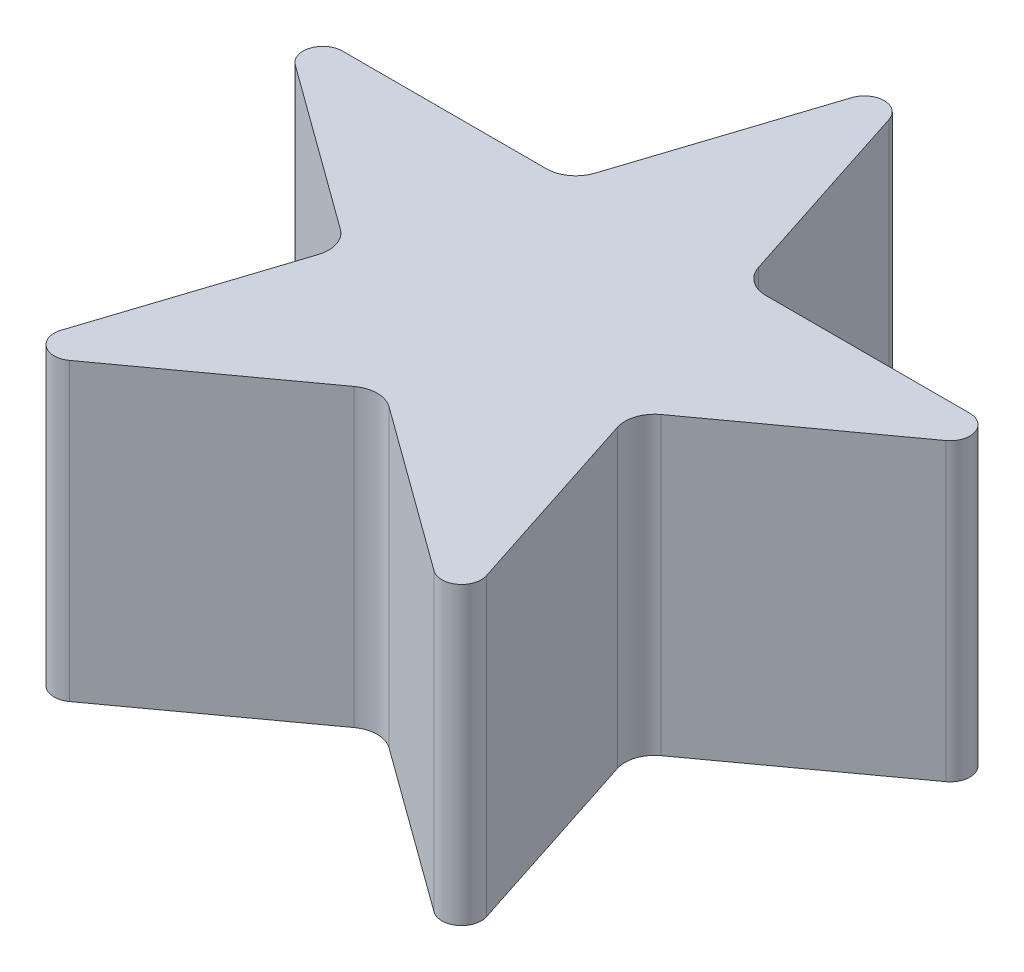
ISO-10303-21;
HEADER;
FILE_DESCRIPTION(('STEP AP214'),'2;1');
FILE_NAME('part.step','',(''),(''),'','','');
FILE_SCHEMA(('AUTOMOTIVE_DESIGN { 1 0 10303 214 1 1 1 1 }'));
ENDSEC;
DATA;
#1=APPLICATION_CONTEXT('core data for automotive mechanical design processes');
#2=APPLICATION_PROTOCOL_DEFINITION('international standard','automotive_design',2000,#1);
#3=PRODUCT_CONTEXT('',#1,'mechanical');
#4=PRODUCT('Part','Part','',(#3));
#5=PRODUCT_RELATED_PRODUCT_CATEGORY('part','',(#4));
#6=PRODUCT_DEFINITION_FORMATION('','',#4);
#7=PRODUCT_DEFINITION_CONTEXT('part definition',#1,'design');
#8=PRODUCT_DEFINITION('design','',#6,#7);
#9=PRODUCT_DEFINITION_SHAPE('','',#8);
#10=(LENGTH_UNIT() NAMED_UNIT(*) SI_UNIT(.MILLI.,.METRE.));
#11=(NAMED_UNIT(*) PLANE_ANGLE_UNIT() SI_UNIT($,.RADIAN.));
#12=(NAMED_UNIT(*) SI_UNIT($,.STERADIAN.) SOLID_ANGLE_UNIT());
#13=UNCERTAINTY_MEASURE_WITH_UNIT(LENGTH_MEASURE(1.E-05),#10,'distance_accuracy_value','');
#14=(GEOMETRIC_REPRESENTATION_CONTEXT(3) GLOBAL_UNCERTAINTY_ASSIGNED_CONTEXT((#13)) GLOBAL_UNIT_ASSIGNED_CONTEXT((#10,
#11,#12)) REPRESENTATION_CONTEXT('',''));
#15=CARTESIAN_POINT('',(0.,0.,0.));
#16=DIRECTION('',(0.,0.,1.));
#17=DIRECTION('',(1.,0.,0.));
#18=AXIS2_PLACEMENT_3D('',#15,#16,#17);
#19=CARTESIAN_POINT('',(7.25857417505104,30.,9.99057026293918));
#20=DIRECTION('',(0.587785252292474,0.,0.809016994374947));
#21=DIRECTION('',(0.809016994374947,0.,-0.587785252292474));
#22=AXIS2_PLACEMENT_3D('',#19,#20,#21);
#23=PLANE('',#22);
#24=DIRECTION('',(-0.809016994374947,0.,0.587785252292474));
#25=VECTOR('',#24,1.);
#26=CARTESIAN_POINT('',(7.25857417505104,30.,9.99057026293918));
#27=LINE('',#26,#25);
#28=CARTESIAN_POINT('',(33.026591230526,30.,-8.73098999023093));
#29=VERTEX_POINT('',#28);
#30=CARTESIAN_POINT('',(16.2805041069795,30.,3.43575448270865));
#31=VERTEX_POINT('',#30);
#32=EDGE_CURVE('E187',#29,#31,#27,.T.);
#33=ORIENTED_EDGE('',*,*,#32,.T.);
#34=DIRECTION('',(0.,-1.,0.));
#35=VECTOR('',#34,1.);
#36=CARTESIAN_POINT('',(16.2805041069795,0.,3.43575448270865));
#37=LINE('',#36,#35);
#38=CARTESIAN_POINT('',(16.2805041069795,0.,3.43575448270865));
#39=VERTEX_POINT('',#38);
#40=EDGE_CURVE('E267',#31,#39,#37,.T.);
#41=ORIENTED_EDGE('',*,*,#40,.T.);
#42=DIRECTION('',(-0.809016994374947,0.,0.587785252292474));
#43=VECTOR('',#42,1.);
#44=CARTESIAN_POINT('',(7.25857417505104,0.,9.99057026293918));
#45=LINE('',#44,#43);
#46=CARTESIAN_POINT('',(33.026591230526,0.,-8.73098999023093));
#47=VERTEX_POINT('',#46);
#48=EDGE_CURVE('E372',#47,#39,#45,.T.);
#49=ORIENTED_EDGE('',*,*,#48,.F.);
#50=DIRECTION('',(0.,-1.,0.));
#51=VECTOR('',#50,1.);
#52=CARTESIAN_POINT('',(33.026591230526,30.,-8.73098999023092));
#53=LINE('',#52,#51);
#54=EDGE_CURVE('E233',#47,#29,#53,.F.);
#55=ORIENTED_EDGE('',*,*,#54,.T.);
#56=EDGE_LOOP('',(#33,#41,#49,#55));
#57=FACE_BOUND('',#56,.T.);
#58=ADVANCED_FACE('F41',(#57),#23,.T.);
#59=CARTESIAN_POINT('',(0.,30.,-12.3490239789808));
#60=DIRECTION('',(0.,0.,1.));
#61=DIRECTION('',(1.,0.,0.));
#62=AXIS2_PLACEMENT_3D('',#59,#60,#61);
#63=PLANE('',#62);
#64=DIRECTION('',(-1.,0.,0.));
#65=VECTOR('',#64,1.);
#66=CARTESIAN_POINT('',(0.,0.,-12.3490239789808));
#67=LINE('',#66,#65);
#68=CARTESIAN_POINT('',(31.8510207259411,0.,-12.3490239789808));
#69=VERTEX_POINT('',#68);
#70=CARTESIAN_POINT('',(11.1517186841036,0.,-12.3490239789808));
#71=VERTEX_POINT('',#70);
#72=EDGE_CURVE('E374',#69,#71,#67,.T.);
#73=ORIENTED_EDGE('',*,*,#72,.T.);
#74=DIRECTION('',(0.,-1.,0.));
#75=VECTOR('',#74,1.);
#76=CARTESIAN_POINT('',(11.1517186841036,30.,-12.3490239789808));
#77=LINE('',#76,#75);
#78=CARTESIAN_POINT('',(11.1517186841036,30.,-12.3490239789808));
#79=VERTEX_POINT('',#78);
#80=EDGE_CURVE('E62',#71,#79,#77,.F.);
#81=ORIENTED_EDGE('',*,*,#80,.T.);
#82=DIRECTION('',(-1.,0.,0.));
#83=VECTOR('',#82,1.);
#84=CARTESIAN_POINT('',(0.,30.,-12.3490239789808));
#85=LINE('',#84,#83);
#86=CARTESIAN_POINT('',(31.8510207259411,30.,-12.3490239789808));
#87=VERTEX_POINT('',#86);
#88=EDGE_CURVE('E302',#87,#79,#85,.T.);
#89=ORIENTED_EDGE('',*,*,#88,.F.);
#90=DIRECTION('',(0.,-1.,0.));
#91=VECTOR('',#90,1.);
#92=CARTESIAN_POINT('',(31.8510207259411,0.,-12.3490239789808));
#93=LINE('',#92,#91);
#94=EDGE_CURVE('E230',#87,#69,#93,.T.);
#95=ORIENTED_EDGE('',*,*,#94,.T.);
#96=EDGE_LOOP('',(#73,#81,#89,#95));
#97=FACE_BOUND('',#96,.T.);
#98=ADVANCED_FACE('F316',(#97),#63,.F.);
#99=CARTESIAN_POINT('',(11.7446197250948,30.,-3.81605827344881));
#100=DIRECTION('',(0.951056516295153,0.,-0.309016994374949));
#101=DIRECTION('',(-0.309016994374949,0.,-0.951056516295153));
#102=AXIS2_PLACEMENT_3D('',#99,#100,#101);
#103=PLANE('',#102);
#104=DIRECTION('',(0.309016994374949,0.,0.951056516295153));
#105=VECTOR('',#104,1.);
#106=CARTESIAN_POINT('',(11.7446197250948,30.,-3.81605827344881));
#107=LINE('',#106,#105);
#108=CARTESIAN_POINT('',(1.90211303259027,30.,-34.1081790855071));
#109=VERTEX_POINT('',#108);
#110=CARTESIAN_POINT('',(8.29854913521813,30.,-14.4219729958559));
#111=VERTEX_POINT('',#110);
#112=EDGE_CURVE('E422',#109,#111,#107,.T.);
#113=ORIENTED_EDGE('',*,*,#112,.T.);
#114=DIRECTION('',(0.,-1.,0.));
#115=VECTOR('',#114,1.);
#116=CARTESIAN_POINT('',(8.29854913521813,30.,-14.421972995856));
#117=LINE('',#116,#115);
#118=CARTESIAN_POINT('',(8.29854913521813,0.,-14.4219729958559));
#119=VERTEX_POINT('',#118);
#120=EDGE_CURVE('E272',#111,#119,#117,.T.);
#121=ORIENTED_EDGE('',*,*,#120,.T.);
#122=DIRECTION('',(0.309016994374949,0.,0.951056516295153));
#123=VECTOR('',#122,1.);
#124=CARTESIAN_POINT('',(11.7446197250948,0.,-3.81605827344881));
#125=LINE('',#124,#123);
#126=CARTESIAN_POINT('',(1.90211303259027,0.,-34.1081790855071));
#127=VERTEX_POINT('',#126);
#128=EDGE_CURVE('E376',#127,#119,#125,.T.);
#129=ORIENTED_EDGE('',*,*,#128,.F.);
#130=DIRECTION('',(0.,-1.,0.));
#131=VECTOR('',#130,1.);
#132=CARTESIAN_POINT('',(1.90211303259027,30.,-34.1081790855071));
#133=LINE('',#132,#131);
#134=EDGE_CURVE('E250',#127,#109,#133,.F.);
#135=ORIENTED_EDGE('',*,*,#134,.T.);
#136=EDGE_LOOP('',(#113,#121,#129,#135));
#137=FACE_BOUND('',#136,.T.);
#138=ADVANCED_FACE('F322',(#137),#103,.T.);
#139=CARTESIAN_POINT('',(-11.7446197250948,30.,-3.81605827344878));
#140=DIRECTION('',(0.951056516295154,0.,0.309016994374946));
#141=DIRECTION('',(0.309016994374946,0.,-0.951056516295154));
#142=AXIS2_PLACEMENT_3D('',#139,#140,#141);
#143=PLANE('',#142);
#144=DIRECTION('',(-0.309016994374946,0.,0.951056516295154));
#145=VECTOR('',#144,1.);
#146=CARTESIAN_POINT('',(-11.7446197250948,0.,-3.81605827344878));
#147=LINE('',#146,#145);
#148=CARTESIAN_POINT('',(-1.90211303259034,0.,-34.1081790855071));
#149=VERTEX_POINT('',#148);
#150=CARTESIAN_POINT('',(-8.29854913521815,0.,-14.4219729958559));
#151=VERTEX_POINT('',#150);
#152=EDGE_CURVE('E378',#149,#151,#147,.T.);
#153=ORIENTED_EDGE('',*,*,#152,.T.);
#154=DIRECTION('',(0.,-1.,0.));
#155=VECTOR('',#154,1.);
#156=CARTESIAN_POINT('',(-8.29854913521815,30.,-14.4219729958559));
#157=LINE('',#156,#155);
#158=CARTESIAN_POINT('',(-8.29854913521815,30.,-14.4219729958559));
#159=VERTEX_POINT('',#158);
#160=EDGE_CURVE('E255',#151,#159,#157,.F.);
#161=ORIENTED_EDGE('',*,*,#160,.T.);
#162=DIRECTION('',(-0.309016994374946,0.,0.951056516295154));
#163=VECTOR('',#162,1.);
#164=CARTESIAN_POINT('',(-11.7446197250948,30.,-3.81605827344878));
#165=LINE('',#164,#163);
#166=CARTESIAN_POINT('',(-1.90211303259034,30.,-34.1081790855071));
#167=VERTEX_POINT('',#166);
#168=EDGE_CURVE('E418',#167,#159,#165,.T.);
#169=ORIENTED_EDGE('',*,*,#168,.F.);
#170=DIRECTION('',(0.,-1.,0.));
#171=VECTOR('',#170,1.);
#172=CARTESIAN_POINT('',(-1.90211303259034,0.,-34.108179085507));
#173=LINE('',#172,#171);
#174=EDGE_CURVE('E247',#167,#149,#173,.T.);
#175=ORIENTED_EDGE('',*,*,#174,.T.);
#176=EDGE_LOOP('',(#153,#161,#169,#175));
#177=FACE_BOUND('',#176,.T.);
#178=ADVANCED_FACE('F417',(#177),#143,.F.);
#179=CARTESIAN_POINT('',(0.,30.,-12.3490239789808));
#180=DIRECTION('',(0.,0.,1.));
#181=DIRECTION('',(1.,0.,0.));
#182=AXIS2_PLACEMENT_3D('',#179,#180,#181);
#183=PLANE('',#182);
#184=DIRECTION('',(-1.,0.,0.));
#185=VECTOR('',#184,1.);
#186=CARTESIAN_POINT('',(0.,30.,-12.3490239789808));
#187=LINE('',#186,#185);
#188=CARTESIAN_POINT('',(-11.1517186841036,30.,-12.3490239789808));
#189=VERTEX_POINT('',#188);
#190=CARTESIAN_POINT('',(-31.8510207259411,30.,-12.3490239789807));
#191=VERTEX_POINT('',#190);
#192=EDGE_CURVE('E366',#189,#191,#187,.T.);
#193=ORIENTED_EDGE('',*,*,#192,.F.);
#194=DIRECTION('',(0.,-1.,0.));
#195=VECTOR('',#194,1.);
#196=CARTESIAN_POINT('',(-11.1517186841036,0.,-12.3490239789808));
#197=LINE('',#196,#195);
#198=CARTESIAN_POINT('',(-11.1517186841036,0.,-12.3490239789808));
#199=VERTEX_POINT('',#198);
#200=EDGE_CURVE('E252',#189,#199,#197,.T.);
#201=ORIENTED_EDGE('',*,*,#200,.T.);
#202=DIRECTION('',(-1.,0.,0.));
#203=VECTOR('',#202,1.);
#204=CARTESIAN_POINT('',(0.,0.,-12.3490239789808));
#205=LINE('',#204,#203);
#206=CARTESIAN_POINT('',(-31.8510207259411,0.,-12.3490239789807));
#207=VERTEX_POINT('',#206);
#208=EDGE_CURVE('E381',#199,#207,#205,.T.);
#209=ORIENTED_EDGE('',*,*,#208,.T.);
#210=DIRECTION('',(0.,-1.,0.));
#211=VECTOR('',#210,1.);
#212=CARTESIAN_POINT('',(-31.8510207259411,30.,-12.3490239789807));
#213=LINE('',#212,#211);
#214=EDGE_CURVE('E244',#207,#191,#213,.F.);
#215=ORIENTED_EDGE('',*,*,#214,.T.);
#216=EDGE_LOOP('',(#193,#201,#209,#215));
#217=FACE_BOUND('',#216,.T.);
#218=ADVANCED_FACE('F410',(#217),#183,.F.);
#219=CARTESIAN_POINT('',(-7.25857417505101,30.,9.9905702629392));
#220=DIRECTION('',(-0.587785252292472,0.,0.809016994374948));
#221=DIRECTION('',(0.809016994374948,0.,0.587785252292472));
#222=AXIS2_PLACEMENT_3D('',#219,#220,#221);
#223=PLANE('',#222);
#224=DIRECTION('',(-0.809016994374948,0.,-0.587785252292472));
#225=VECTOR('',#224,1.);
#226=CARTESIAN_POINT('',(-7.25857417505101,0.,9.9905702629392));
#227=LINE('',#226,#225);
#228=CARTESIAN_POINT('',(-16.2805041069794,0.,3.43575448270869));
#229=VERTEX_POINT('',#228);
#230=CARTESIAN_POINT('',(-33.0265912305261,0.,-8.73098999023085));
#231=VERTEX_POINT('',#230);
#232=EDGE_CURVE('E383',#229,#231,#227,.T.);
#233=ORIENTED_EDGE('',*,*,#232,.F.);
#234=DIRECTION('',(0.,-1.,0.));
#235=VECTOR('',#234,1.);
#236=CARTESIAN_POINT('',(-16.2805041069794,30.,3.43575448270869));
#237=LINE('',#236,#235);
#238=CARTESIAN_POINT('',(-16.2805041069794,30.,3.43575448270869));
#239=VERTEX_POINT('',#238);
#240=EDGE_CURVE('E260',#229,#239,#237,.F.);
#241=ORIENTED_EDGE('',*,*,#240,.T.);
#242=DIRECTION('',(-0.809016994374948,0.,-0.587785252292472));
#243=VECTOR('',#242,1.);
#244=CARTESIAN_POINT('',(-7.25857417505101,30.,9.9905702629392));
#245=LINE('',#244,#243);
#246=CARTESIAN_POINT('',(-33.0265912305261,30.,-8.73098999023085));
#247=VERTEX_POINT('',#246);
#248=EDGE_CURVE('E357',#239,#247,#245,.T.);
#249=ORIENTED_EDGE('',*,*,#248,.T.);
#250=DIRECTION('',(0.,-1.,0.));
#251=VECTOR('',#250,1.);
#252=CARTESIAN_POINT('',(-33.0265912305261,0.,-8.73098999023085));
#253=LINE('',#252,#251);
#254=EDGE_CURVE('E241',#247,#231,#253,.T.);
#255=ORIENTED_EDGE('',*,*,#254,.T.);
#256=EDGE_LOOP('',(#233,#241,#249,#255));
#257=FACE_BOUND('',#256,.T.);
#258=ADVANCED_FACE('F402',(#257),#223,.T.);
#259=CARTESIAN_POINT('',(-11.7446197250948,30.,-3.81605827344878));
#260=DIRECTION('',(0.951056516295154,0.,0.309016994374946));
#261=DIRECTION('',(0.309016994374946,0.,-0.951056516295154));
#262=AXIS2_PLACEMENT_3D('',#259,#260,#261);
#263=PLANE('',#262);
#264=DIRECTION('',(-0.309016994374946,0.,0.951056516295154));
#265=VECTOR('',#264,1.);
#266=CARTESIAN_POINT('',(-11.7446197250948,30.,-3.81605827344878));
#267=LINE('',#266,#265);
#268=CARTESIAN_POINT('',(-15.1906903149714,30.,6.78985644895838));
#269=VERTEX_POINT('',#268);
#270=CARTESIAN_POINT('',(-21.5871264175992,30.,26.4760625386095));
#271=VERTEX_POINT('',#270);
#272=EDGE_CURVE('E356',#269,#271,#267,.T.);
#273=ORIENTED_EDGE('',*,*,#272,.F.);
#274=DIRECTION('',(0.,-1.,0.));
#275=VECTOR('',#274,1.);
#276=CARTESIAN_POINT('',(-15.1906903149714,30.,6.78985644895838));
#277=LINE('',#276,#275);
#278=CARTESIAN_POINT('',(-15.1906903149714,0.,6.78985644895838));
#279=VERTEX_POINT('',#278);
#280=EDGE_CURVE('E257',#269,#279,#277,.T.);
#281=ORIENTED_EDGE('',*,*,#280,.T.);
#282=DIRECTION('',(-0.309016994374946,0.,0.951056516295154));
#283=VECTOR('',#282,1.);
#284=CARTESIAN_POINT('',(-11.7446197250948,0.,-3.81605827344878));
#285=LINE('',#284,#283);
#286=CARTESIAN_POINT('',(-21.5871264175992,0.,26.4760625386095));
#287=VERTEX_POINT('',#286);
#288=EDGE_CURVE('E385',#279,#287,#285,.T.);
#289=ORIENTED_EDGE('',*,*,#288,.T.);
#290=DIRECTION('',(0.,-1.,0.));
#291=VECTOR('',#290,1.);
#292=CARTESIAN_POINT('',(-21.5871264175992,30.,26.4760625386095));
#293=LINE('',#292,#291);
#294=EDGE_CURVE('E238',#287,#271,#293,.F.);
#295=ORIENTED_EDGE('',*,*,#294,.T.);
#296=EDGE_LOOP('',(#273,#281,#289,#295));
#297=FACE_BOUND('',#296,.T.);
#298=ADVANCED_FACE('F359',(#297),#263,.F.);
#299=CARTESIAN_POINT('',(7.25857417505104,30.,9.99057026293918));
#300=DIRECTION('',(0.587785252292474,0.,0.809016994374947));
#301=DIRECTION('',(0.809016994374947,0.,-0.587785252292474));
#302=AXIS2_PLACEMENT_3D('',#299,#300,#301);
#303=PLANE('',#302);
#304=DIRECTION('',(-0.809016994374947,0.,0.587785252292474));
#305=VECTOR('',#304,1.);
#306=CARTESIAN_POINT('',(7.25857417505104,0.,9.99057026293918));
#307=LINE('',#306,#305);
#308=CARTESIAN_POINT('',(-1.76335575687739,0.,16.5453860431697));
#309=VERTEX_POINT('',#308);
#310=CARTESIAN_POINT('',(-18.509442880424,0.,28.7121305161093));
#311=VERTEX_POINT('',#310);
#312=EDGE_CURVE('E387',#309,#311,#307,.T.);
#313=ORIENTED_EDGE('',*,*,#312,.F.);
#314=DIRECTION('',(0.,-1.,0.));
#315=VECTOR('',#314,1.);
#316=CARTESIAN_POINT('',(-1.76335575687739,30.,16.5453860431697));
#317=LINE('',#316,#315);
#318=CARTESIAN_POINT('',(-1.76335575687739,30.,16.5453860431697));
#319=VERTEX_POINT('',#318);
#320=EDGE_CURVE('E265',#309,#319,#317,.F.);
#321=ORIENTED_EDGE('',*,*,#320,.T.);
#322=DIRECTION('',(-0.809016994374947,0.,0.587785252292474));
#323=VECTOR('',#322,1.);
#324=CARTESIAN_POINT('',(7.25857417505104,30.,9.99057026293918));
#325=LINE('',#324,#323);
#326=CARTESIAN_POINT('',(-18.509442880424,30.,28.7121305161093));
#327=VERTEX_POINT('',#326);
#328=EDGE_CURVE('E363',#319,#327,#325,.T.);
#329=ORIENTED_EDGE('',*,*,#328,.T.);
#330=DIRECTION('',(0.,-1.,0.));
#331=VECTOR('',#330,1.);
#332=CARTESIAN_POINT('',(-18.509442880424,0.,28.7121305161093));
#333=LINE('',#332,#331);
#334=EDGE_CURVE('E235',#327,#311,#333,.T.);
#335=ORIENTED_EDGE('',*,*,#334,.T.);
#336=EDGE_LOOP('',(#313,#321,#329,#335));
#337=FACE_BOUND('',#336,.T.);
#338=ADVANCED_FACE('F396',(#337),#303,.T.);
#339=CARTESIAN_POINT('',(-7.25857417505101,30.,9.9905702629392));
#340=DIRECTION('',(-0.587785252292472,0.,0.809016994374948));
#341=DIRECTION('',(0.809016994374948,0.,0.587785252292472));
#342=AXIS2_PLACEMENT_3D('',#339,#340,#341);
#343=PLANE('',#342);
#344=DIRECTION('',(-0.809016994374948,0.,-0.587785252292472));
#345=VECTOR('',#344,1.);
#346=CARTESIAN_POINT('',(-7.25857417505101,30.,9.9905702629392));
#347=LINE('',#346,#345);
#348=CARTESIAN_POINT('',(18.509442880424,30.,28.7121305161092));
#349=VERTEX_POINT('',#348);
#350=CARTESIAN_POINT('',(1.76335575687745,30.,16.5453860431697));
#351=VERTEX_POINT('',#350);
#352=EDGE_CURVE('E207',#349,#351,#347,.T.);
#353=ORIENTED_EDGE('',*,*,#352,.T.);
#354=DIRECTION('',(0.,-1.,0.));
#355=VECTOR('',#354,1.);
#356=CARTESIAN_POINT('',(1.76335575687745,0.,16.5453860431697));
#357=LINE('',#356,#355);
#358=CARTESIAN_POINT('',(1.76335575687745,0.,16.5453860431697));
#359=VERTEX_POINT('',#358);
#360=EDGE_CURVE('E262',#351,#359,#357,.T.);
#361=ORIENTED_EDGE('',*,*,#360,.T.);
#362=DIRECTION('',(-0.809016994374948,0.,-0.587785252292472));
#363=VECTOR('',#362,1.);
#364=CARTESIAN_POINT('',(-7.25857417505101,0.,9.9905702629392));
#365=LINE('',#364,#363);
#366=CARTESIAN_POINT('',(18.509442880424,0.,28.7121305161092));
#367=VERTEX_POINT('',#366);
#368=EDGE_CURVE('E188',#367,#359,#365,.T.);
#369=ORIENTED_EDGE('',*,*,#368,.F.);
#370=DIRECTION('',(0.,-1.,0.));
#371=VECTOR('',#370,1.);
#372=CARTESIAN_POINT('',(18.509442880424,30.,28.7121305161092));
#373=LINE('',#372,#371);
#374=EDGE_CURVE('E196',#367,#349,#373,.F.);
#375=ORIENTED_EDGE('',*,*,#374,.T.);
#376=EDGE_LOOP('',(#353,#361,#369,#375));
#377=FACE_BOUND('',#376,.T.);
#378=ADVANCED_FACE('F390',(#377),#343,.T.);
#379=CARTESIAN_POINT('',(11.7446197250948,30.,-3.81605827344881));
#380=DIRECTION('',(0.951056516295153,0.,-0.309016994374949));
#381=DIRECTION('',(-0.309016994374949,0.,-0.951056516295153));
#382=AXIS2_PLACEMENT_3D('',#379,#380,#381);
#383=PLANE('',#382);
#384=DIRECTION('',(0.309016994374949,0.,0.951056516295153));
#385=VECTOR('',#384,1.);
#386=CARTESIAN_POINT('',(11.7446197250948,0.,-3.81605827344881));
#387=LINE('',#386,#385);
#388=CARTESIAN_POINT('',(15.1906903149714,0.,6.78985644895833));
#389=VERTEX_POINT('',#388);
#390=CARTESIAN_POINT('',(21.5871264175993,0.,26.4760625386094));
#391=VERTEX_POINT('',#390);
#392=EDGE_CURVE('E176',#389,#391,#387,.T.);
#393=ORIENTED_EDGE('',*,*,#392,.F.);
#394=DIRECTION('',(0.,-1.,0.));
#395=VECTOR('',#394,1.);
#396=CARTESIAN_POINT('',(15.1906903149714,30.,6.78985644895833));
#397=LINE('',#396,#395);
#398=CARTESIAN_POINT('',(15.1906903149714,30.,6.78985644895833));
#399=VERTEX_POINT('',#398);
#400=EDGE_CURVE('E270',#389,#399,#397,.F.);
#401=ORIENTED_EDGE('',*,*,#400,.T.);
#402=DIRECTION('',(0.309016994374949,0.,0.951056516295153));
#403=VECTOR('',#402,1.);
#404=CARTESIAN_POINT('',(11.7446197250948,30.,-3.81605827344881));
#405=LINE('',#404,#403);
#406=CARTESIAN_POINT('',(21.5871264175993,30.,26.4760625386094));
#407=VERTEX_POINT('',#406);
#408=EDGE_CURVE('E201',#399,#407,#405,.T.);
#409=ORIENTED_EDGE('',*,*,#408,.T.);
#410=DIRECTION('',(0.,-1.,0.));
#411=VECTOR('',#410,1.);
#412=CARTESIAN_POINT('',(21.5871264175993,30.,26.4760625386094));
#413=LINE('',#412,#411);
#414=EDGE_CURVE('E195',#407,#391,#413,.T.);
#415=ORIENTED_EDGE('',*,*,#414,.T.);
#416=EDGE_LOOP('',(#393,#401,#409,#415));
#417=FACE_BOUND('',#416,.T.);
#418=ADVANCED_FACE('F199',(#417),#383,.T.);
#419=CARTESIAN_POINT('',(0.,30.,0.));
#420=DIRECTION('',(0.,1.,0.));
#421=DIRECTION('',(0.,0.,1.));
#422=AXIS2_PLACEMENT_3D('',#419,#420,#421);
#423=PLANE('',#422);
#424=ORIENTED_EDGE('',*,*,#352,.F.);
#425=CARTESIAN_POINT('',(19.685013385009,30.,27.0940965273593));
#426=DIRECTION('',(0.,1.,0.));
#427=DIRECTION('',(0.,0.,1.));
#428=AXIS2_PLACEMENT_3D('',#425,#426,#427);
#429=CIRCLE('',#428,2.);
#430=EDGE_CURVE('E228',#349,#407,#429,.T.);
#431=ORIENTED_EDGE('',*,*,#430,.T.);
#432=ORIENTED_EDGE('',*,*,#408,.F.);
#433=CARTESIAN_POINT('',(18.0438598638569,30.,5.86280546583349));
#434=DIRECTION('',(0.,1.,0.));
#435=DIRECTION('',(0.,0.,1.));
#436=AXIS2_PLACEMENT_3D('',#433,#434,#435);
#437=CIRCLE('',#436,3.);
#438=EDGE_CURVE('E289',#399,#31,#437,.F.);
#439=ORIENTED_EDGE('',*,*,#438,.T.);
#440=ORIENTED_EDGE('',*,*,#32,.F.);
#441=CARTESIAN_POINT('',(31.8510207259411,30.,-10.3490239789808));
#442=DIRECTION('',(0.,1.,0.));
#443=DIRECTION('',(0.,0.,1.));
#444=AXIS2_PLACEMENT_3D('',#441,#442,#443);
#445=CIRCLE('',#444,2.);
#446=EDGE_CURVE('E226',#29,#87,#445,.T.);
#447=ORIENTED_EDGE('',*,*,#446,.T.);
#448=ORIENTED_EDGE('',*,*,#88,.T.);
#449=CARTESIAN_POINT('',(11.1517186841036,30.,-15.3490239789808));
#450=DIRECTION('',(0.,1.,0.));
#451=DIRECTION('',(0.,0.,1.));
#452=AXIS2_PLACEMENT_3D('',#449,#450,#451);
#453=CIRCLE('',#452,3.);
#454=EDGE_CURVE('E11',#79,#111,#453,.F.);
#455=ORIENTED_EDGE('',*,*,#454,.T.);
#456=ORIENTED_EDGE('',*,*,#112,.F.);
#457=CARTESIAN_POINT('',(0.,30.,-33.4901450967572));
#458=DIRECTION('',(0.,1.,0.));
#459=DIRECTION('',(0.,0.,1.));
#460=AXIS2_PLACEMENT_3D('',#457,#458,#459);
#461=CIRCLE('',#460,2.);
#462=EDGE_CURVE('E218',#109,#167,#461,.T.);
#463=ORIENTED_EDGE('',*,*,#462,.T.);
#464=ORIENTED_EDGE('',*,*,#168,.T.);
#465=CARTESIAN_POINT('',(-11.1517186841036,30.,-15.3490239789808));
#466=DIRECTION('',(0.,1.,0.));
#467=DIRECTION('',(0.,0.,1.));
#468=AXIS2_PLACEMENT_3D('',#465,#466,#467);
#469=CIRCLE('',#468,3.);
#470=EDGE_CURVE('E278',#159,#189,#469,.F.);
#471=ORIENTED_EDGE('',*,*,#470,.T.);
#472=ORIENTED_EDGE('',*,*,#192,.T.);
#473=CARTESIAN_POINT('',(-31.8510207259411,30.,-10.3490239789807));
#474=DIRECTION('',(0.,1.,0.));
#475=DIRECTION('',(0.,0.,1.));
#476=AXIS2_PLACEMENT_3D('',#473,#474,#475);
#477=CIRCLE('',#476,2.);
#478=EDGE_CURVE('E220',#191,#247,#477,.T.);
#479=ORIENTED_EDGE('',*,*,#478,.T.);
#480=ORIENTED_EDGE('',*,*,#248,.F.);
#481=CARTESIAN_POINT('',(-18.0438598638569,30.,5.86280546583354));
#482=DIRECTION('',(0.,1.,0.));
#483=DIRECTION('',(0.,0.,1.));
#484=AXIS2_PLACEMENT_3D('',#481,#482,#483);
#485=CIRCLE('',#484,3.);
#486=EDGE_CURVE('E282',#239,#269,#485,.F.);
#487=ORIENTED_EDGE('',*,*,#486,.T.);
#488=ORIENTED_EDGE('',*,*,#272,.T.);
#489=CARTESIAN_POINT('',(-19.6850133850089,30.,27.0940965273594));
#490=DIRECTION('',(0.,1.,0.));
#491=DIRECTION('',(0.,0.,1.));
#492=AXIS2_PLACEMENT_3D('',#489,#490,#491);
#493=CIRCLE('',#492,2.);
#494=EDGE_CURVE('E223',#271,#327,#493,.T.);
#495=ORIENTED_EDGE('',*,*,#494,.T.);
#496=ORIENTED_EDGE('',*,*,#328,.F.);
#497=CARTESIAN_POINT('',(0.,30.,18.9724370262945));
#498=DIRECTION('',(0.,1.,0.));
#499=DIRECTION('',(0.,0.,1.));
#500=AXIS2_PLACEMENT_3D('',#497,#498,#499);
#501=CIRCLE('',#500,3.);
#502=EDGE_CURVE('E286',#319,#351,#501,.F.);
#503=ORIENTED_EDGE('',*,*,#502,.T.);
#504=EDGE_LOOP('',(#424,#431,#432,#439,#440,#447,#448,#455,#456,#463,#464,#471,#472,#479,#480,
#487,#488,#495,#496,#503));
#505=FACE_BOUND('',#504,.T.);
#506=ADVANCED_FACE('F295',(#505),#423,.T.);
#507=CARTESIAN_POINT('',(0.,0.,0.));
#508=DIRECTION('',(0.,1.,0.));
#509=DIRECTION('',(0.,0.,1.));
#510=AXIS2_PLACEMENT_3D('',#507,#508,#509);
#511=PLANE('',#510);
#512=ORIENTED_EDGE('',*,*,#48,.T.);
#513=CARTESIAN_POINT('',(18.0438598638569,0.,5.86280546583349));
#514=DIRECTION('',(0.,1.,0.));
#515=DIRECTION('',(0.,0.,1.));
#516=AXIS2_PLACEMENT_3D('',#513,#514,#515);
#517=CIRCLE('',#516,3.);
#518=EDGE_CURVE('E183',#39,#389,#517,.T.);
#519=ORIENTED_EDGE('',*,*,#518,.T.);
#520=ORIENTED_EDGE('',*,*,#392,.T.);
#521=CARTESIAN_POINT('',(19.685013385009,0.,27.0940965273593));
#522=DIRECTION('',(0.,1.,0.));
#523=DIRECTION('',(0.,0.,1.));
#524=AXIS2_PLACEMENT_3D('',#521,#522,#523);
#525=CIRCLE('',#524,2.);
#526=EDGE_CURVE('E181',#391,#367,#525,.F.);
#527=ORIENTED_EDGE('',*,*,#526,.T.);
#528=ORIENTED_EDGE('',*,*,#368,.T.);
#529=CARTESIAN_POINT('',(0.,0.,18.9724370262945));
#530=DIRECTION('',(0.,1.,0.));
#531=DIRECTION('',(0.,0.,1.));
#532=AXIS2_PLACEMENT_3D('',#529,#530,#531);
#533=CIRCLE('',#532,3.);
#534=EDGE_CURVE('E284',#359,#309,#533,.T.);
#535=ORIENTED_EDGE('',*,*,#534,.T.);
#536=ORIENTED_EDGE('',*,*,#312,.T.);
#537=CARTESIAN_POINT('',(-19.6850133850089,0.,27.0940965273594));
#538=DIRECTION('',(0.,1.,0.));
#539=DIRECTION('',(0.,0.,1.));
#540=AXIS2_PLACEMENT_3D('',#537,#538,#539);
#541=CIRCLE('',#540,2.);
#542=EDGE_CURVE('E213',#311,#287,#541,.F.);
#543=ORIENTED_EDGE('',*,*,#542,.T.);
#544=ORIENTED_EDGE('',*,*,#288,.F.);
#545=CARTESIAN_POINT('',(-18.0438598638569,0.,5.86280546583354));
#546=DIRECTION('',(0.,1.,0.));
#547=DIRECTION('',(0.,0.,1.));
#548=AXIS2_PLACEMENT_3D('',#545,#546,#547);
#549=CIRCLE('',#548,3.);
#550=EDGE_CURVE('E280',#279,#229,#549,.T.);
#551=ORIENTED_EDGE('',*,*,#550,.T.);
#552=ORIENTED_EDGE('',*,*,#232,.T.);
#553=CARTESIAN_POINT('',(-31.8510207259411,0.,-10.3490239789807));
#554=DIRECTION('',(0.,1.,0.));
#555=DIRECTION('',(0.,0.,1.));
#556=AXIS2_PLACEMENT_3D('',#553,#554,#555);
#557=CIRCLE('',#556,2.);
#558=EDGE_CURVE('E205',#231,#207,#557,.F.);
#559=ORIENTED_EDGE('',*,*,#558,.T.);
#560=ORIENTED_EDGE('',*,*,#208,.F.);
#561=CARTESIAN_POINT('',(-11.1517186841036,0.,-15.3490239789808));
#562=DIRECTION('',(0.,1.,0.));
#563=DIRECTION('',(0.,0.,1.));
#564=AXIS2_PLACEMENT_3D('',#561,#562,#563);
#565=CIRCLE('',#564,3.);
#566=EDGE_CURVE('E276',#199,#151,#565,.T.);
#567=ORIENTED_EDGE('',*,*,#566,.T.);
#568=ORIENTED_EDGE('',*,*,#152,.F.);
#569=CARTESIAN_POINT('',(0.,0.,-33.4901450967572));
#570=DIRECTION('',(0.,1.,0.));
#571=DIRECTION('',(0.,0.,1.));
#572=AXIS2_PLACEMENT_3D('',#569,#570,#571);
#573=CIRCLE('',#572,2.);
#574=EDGE_CURVE('E203',#149,#127,#573,.F.);
#575=ORIENTED_EDGE('',*,*,#574,.T.);
#576=ORIENTED_EDGE('',*,*,#128,.T.);
#577=CARTESIAN_POINT('',(11.1517186841036,0.,-15.3490239789808));
#578=DIRECTION('',(0.,1.,0.));
#579=DIRECTION('',(0.,0.,1.));
#580=AXIS2_PLACEMENT_3D('',#577,#578,#579);
#581=CIRCLE('',#580,3.);
#582=EDGE_CURVE('E49',#119,#71,#581,.T.);
#583=ORIENTED_EDGE('',*,*,#582,.T.);
#584=ORIENTED_EDGE('',*,*,#72,.F.);
#585=CARTESIAN_POINT('',(31.8510207259411,0.,-10.3490239789808));
#586=DIRECTION('',(0.,1.,0.));
#587=DIRECTION('',(0.,0.,1.));
#588=AXIS2_PLACEMENT_3D('',#585,#586,#587);
#589=CIRCLE('',#588,2.);
#590=EDGE_CURVE('E197',#69,#47,#589,.F.);
#591=ORIENTED_EDGE('',*,*,#590,.T.);
#592=EDGE_LOOP('',(#512,#519,#520,#527,#528,#535,#536,#543,#544,#551,#552,#559,#560,#567,#568,
#575,#576,#583,#584,#591));
#593=FACE_BOUND('',#592,.T.);
#594=ADVANCED_FACE('F179',(#593),#511,.F.);
#595=CARTESIAN_POINT('',(19.685013385009,30.,27.0940965273593));
#596=DIRECTION('',(0.,-1.,0.));
#597=DIRECTION('',(0.,0.,-1.));
#598=AXIS2_PLACEMENT_3D('',#595,#596,#597);
#599=CYLINDRICAL_SURFACE('',#598,2.);
#600=ORIENTED_EDGE('',*,*,#430,.F.);
#601=ORIENTED_EDGE('',*,*,#374,.F.);
#602=ORIENTED_EDGE('',*,*,#526,.F.);
#603=ORIENTED_EDGE('',*,*,#414,.F.);
#604=EDGE_LOOP('',(#600,#601,#602,#603));
#605=FACE_BOUND('',#604,.T.);
#606=ADVANCED_FACE('F194',(#605),#599,.T.);
#607=CARTESIAN_POINT('',(31.8510207259411,30.,-10.3490239789808));
#608=DIRECTION('',(0.,1.,0.));
#609=DIRECTION('',(0.,0.,1.));
#610=AXIS2_PLACEMENT_3D('',#607,#608,#609);
#611=CYLINDRICAL_SURFACE('',#610,2.);
#612=ORIENTED_EDGE('',*,*,#446,.F.);
#613=ORIENTED_EDGE('',*,*,#54,.F.);
#614=ORIENTED_EDGE('',*,*,#590,.F.);
#615=ORIENTED_EDGE('',*,*,#94,.F.);
#616=EDGE_LOOP('',(#612,#613,#614,#615));
#617=FACE_BOUND('',#616,.T.);
#618=ADVANCED_FACE('F328',(#617),#611,.T.);
#619=CARTESIAN_POINT('',(-19.6850133850089,30.,27.0940965273594));
#620=DIRECTION('',(0.,1.,0.));
#621=DIRECTION('',(0.,0.,1.));
#622=AXIS2_PLACEMENT_3D('',#619,#620,#621);
#623=CYLINDRICAL_SURFACE('',#622,2.);
#624=ORIENTED_EDGE('',*,*,#494,.F.);
#625=ORIENTED_EDGE('',*,*,#294,.F.);
#626=ORIENTED_EDGE('',*,*,#542,.F.);
#627=ORIENTED_EDGE('',*,*,#334,.F.);
#628=EDGE_LOOP('',(#624,#625,#626,#627));
#629=FACE_BOUND('',#628,.T.);
#630=ADVANCED_FACE('F331',(#629),#623,.T.);
#631=CARTESIAN_POINT('',(-31.8510207259411,30.,-10.3490239789807));
#632=DIRECTION('',(0.,1.,0.));
#633=DIRECTION('',(0.,0.,1.));
#634=AXIS2_PLACEMENT_3D('',#631,#632,#633);
#635=CYLINDRICAL_SURFACE('',#634,2.);
#636=ORIENTED_EDGE('',*,*,#478,.F.);
#637=ORIENTED_EDGE('',*,*,#214,.F.);
#638=ORIENTED_EDGE('',*,*,#558,.F.);
#639=ORIENTED_EDGE('',*,*,#254,.F.);
#640=EDGE_LOOP('',(#636,#637,#638,#639));
#641=FACE_BOUND('',#640,.T.);
#642=ADVANCED_FACE('F335',(#641),#635,.T.);
#643=CARTESIAN_POINT('',(0.,30.,-33.4901450967572));
#644=DIRECTION('',(0.,1.,0.));
#645=DIRECTION('',(0.,0.,1.));
#646=AXIS2_PLACEMENT_3D('',#643,#644,#645);
#647=CYLINDRICAL_SURFACE('',#646,2.);
#648=ORIENTED_EDGE('',*,*,#462,.F.);
#649=ORIENTED_EDGE('',*,*,#134,.F.);
#650=ORIENTED_EDGE('',*,*,#574,.F.);
#651=ORIENTED_EDGE('',*,*,#174,.F.);
#652=EDGE_LOOP('',(#648,#649,#650,#651));
#653=FACE_BOUND('',#652,.T.);
#654=ADVANCED_FACE('F339',(#653),#647,.T.);
#655=CARTESIAN_POINT('',(-11.1517186841036,30.,-15.3490239789808));
#656=DIRECTION('',(0.,1.,0.));
#657=DIRECTION('',(0.,0.,1.));
#658=AXIS2_PLACEMENT_3D('',#655,#656,#657);
#659=CYLINDRICAL_SURFACE('',#658,3.);
#660=ORIENTED_EDGE('',*,*,#470,.F.);
#661=ORIENTED_EDGE('',*,*,#160,.F.);
#662=ORIENTED_EDGE('',*,*,#566,.F.);
#663=ORIENTED_EDGE('',*,*,#200,.F.);
#664=EDGE_LOOP('',(#660,#661,#662,#663));
#665=FACE_BOUND('',#664,.T.);
#666=ADVANCED_FACE('F342',(#665),#659,.F.);
#667=CARTESIAN_POINT('',(-18.0438598638569,30.,5.86280546583354));
#668=DIRECTION('',(0.,-1.,0.));
#669=DIRECTION('',(0.,0.,-1.));
#670=AXIS2_PLACEMENT_3D('',#667,#668,#669);
#671=CYLINDRICAL_SURFACE('',#670,3.);
#672=ORIENTED_EDGE('',*,*,#486,.F.);
#673=ORIENTED_EDGE('',*,*,#240,.F.);
#674=ORIENTED_EDGE('',*,*,#550,.F.);
#675=ORIENTED_EDGE('',*,*,#280,.F.);
#676=EDGE_LOOP('',(#672,#673,#674,#675));
#677=FACE_BOUND('',#676,.T.);
#678=ADVANCED_FACE('F312',(#677),#671,.F.);
#679=CARTESIAN_POINT('',(0.,30.,18.9724370262945));
#680=DIRECTION('',(0.,1.,0.));
#681=DIRECTION('',(0.,0.,1.));
#682=AXIS2_PLACEMENT_3D('',#679,#680,#681);
#683=CYLINDRICAL_SURFACE('',#682,3.);
#684=ORIENTED_EDGE('',*,*,#502,.F.);
#685=ORIENTED_EDGE('',*,*,#320,.F.);
#686=ORIENTED_EDGE('',*,*,#534,.F.);
#687=ORIENTED_EDGE('',*,*,#360,.F.);
#688=EDGE_LOOP('',(#684,#685,#686,#687));
#689=FACE_BOUND('',#688,.T.);
#690=ADVANCED_FACE('F306',(#689),#683,.F.);
#691=CARTESIAN_POINT('',(18.0438598638569,30.,5.86280546583349));
#692=DIRECTION('',(0.,1.,0.));
#693=DIRECTION('',(0.,0.,1.));
#694=AXIS2_PLACEMENT_3D('',#691,#692,#693);
#695=CYLINDRICAL_SURFACE('',#694,3.);
#696=ORIENTED_EDGE('',*,*,#438,.F.);
#697=ORIENTED_EDGE('',*,*,#400,.F.);
#698=ORIENTED_EDGE('',*,*,#518,.F.);
#699=ORIENTED_EDGE('',*,*,#40,.F.);
#700=EDGE_LOOP('',(#696,#697,#698,#699));
#701=FACE_BOUND('',#700,.T.);
#702=ADVANCED_FACE('F304',(#701),#695,.F.);
#703=CARTESIAN_POINT('',(11.1517186841036,30.,-15.3490239789808));
#704=DIRECTION('',(0.,-1.,0.));
#705=DIRECTION('',(0.,0.,-1.));
#706=AXIS2_PLACEMENT_3D('',#703,#704,#705);
#707=CYLINDRICAL_SURFACE('',#706,3.);
#708=ORIENTED_EDGE('',*,*,#454,.F.);
#709=ORIENTED_EDGE('',*,*,#80,.F.);
#710=ORIENTED_EDGE('',*,*,#582,.F.);
#711=ORIENTED_EDGE('',*,*,#120,.F.);
#712=EDGE_LOOP('',(#708,#709,#710,#711));
#713=FACE_BOUND('',#712,.T.);
#714=ADVANCED_FACE('F43',(#713),#707,.F.);
#715=CLOSED_SHELL('',(#58,#98,#138,#178,#218,#258,#298,#338,#378,#418,#506,#594,#606,#618,#630,
#642,#654,#666,#678,#690,#702,#714));
#716=MANIFOLD_SOLID_BREP('B2',#715);
#717=ADVANCED_BREP_SHAPE_REPRESENTATION('',(#18,#716),#14);
#718=SHAPE_DEFINITION_REPRESENTATION(#9,#717);
ENDSEC;
END-ISO-10303-21;
